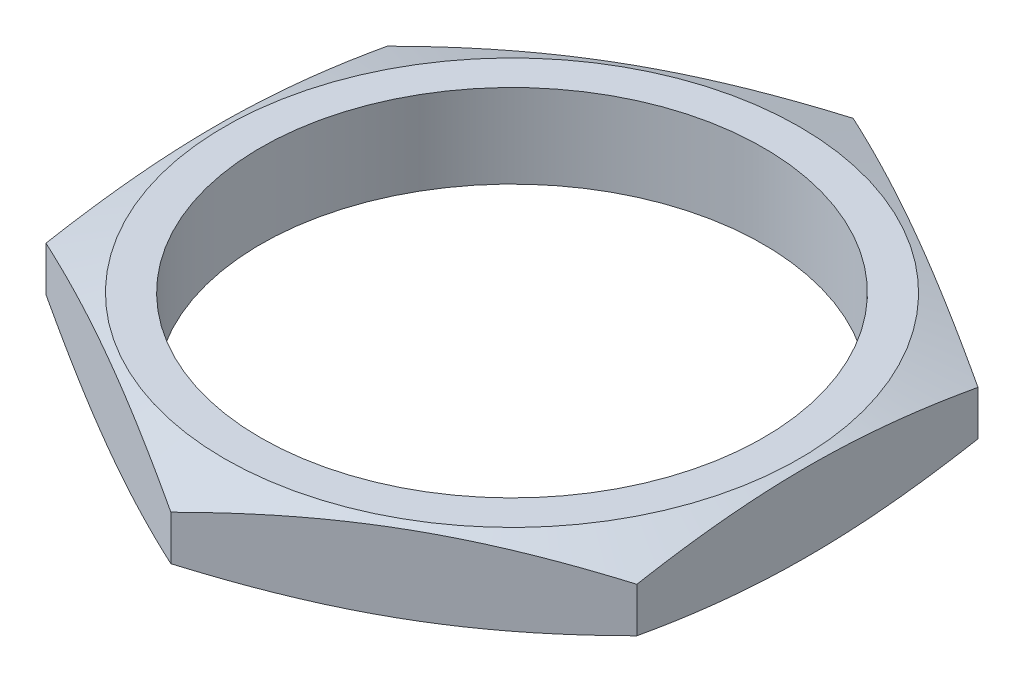
ISO-10303-21;
HEADER;
FILE_DESCRIPTION(('STEP AP214'),'2;1');
FILE_NAME('part.step','',(''),(''),'','','');
FILE_SCHEMA(('AUTOMOTIVE_DESIGN { 1 0 10303 214 1 1 1 1 }'));
ENDSEC;
DATA;
#1=APPLICATION_CONTEXT('core data for automotive mechanical design processes');
#2=APPLICATION_PROTOCOL_DEFINITION('international standard','automotive_design',2000,#1);
#3=PRODUCT_CONTEXT('',#1,'mechanical');
#4=PRODUCT('Part','Part','',(#3));
#5=PRODUCT_RELATED_PRODUCT_CATEGORY('part','',(#4));
#6=PRODUCT_DEFINITION_FORMATION('','',#4);
#7=PRODUCT_DEFINITION_CONTEXT('part definition',#1,'design');
#8=PRODUCT_DEFINITION('design','',#6,#7);
#9=PRODUCT_DEFINITION_SHAPE('','',#8);
#10=(LENGTH_UNIT() NAMED_UNIT(*) SI_UNIT(.MILLI.,.METRE.));
#11=(NAMED_UNIT(*) PLANE_ANGLE_UNIT() SI_UNIT($,.RADIAN.));
#12=(NAMED_UNIT(*) SI_UNIT($,.STERADIAN.) SOLID_ANGLE_UNIT());
#13=UNCERTAINTY_MEASURE_WITH_UNIT(LENGTH_MEASURE(1.E-05),#10,'distance_accuracy_value','');
#14=(GEOMETRIC_REPRESENTATION_CONTEXT(3) GLOBAL_UNCERTAINTY_ASSIGNED_CONTEXT((#13)) GLOBAL_UNIT_ASSIGNED_CONTEXT((#10,
#11,#12)) REPRESENTATION_CONTEXT('',''));
#15=CARTESIAN_POINT('',(0.,0.,0.));
#16=DIRECTION('',(0.,0.,1.));
#17=DIRECTION('',(1.,0.,0.));
#18=AXIS2_PLACEMENT_3D('',#15,#16,#17);
#19=CARTESIAN_POINT('',(-6.9977,1.9812,4.04012397870825));
#20=DIRECTION('',(0.5,0.,-0.866025403784439));
#21=DIRECTION('',(-0.866025403784439,0.,-0.5));
#22=AXIS2_PLACEMENT_3D('',#19,#20,#21);
#23=PLANE('',#22);
#24=CARTESIAN_POINT('',(0.0001999999999964,0.462284226081492,8.08036342747033));
#25=CARTESIAN_POINT('',(-0.289606622206514,0.401362120566391,7.91304349612647));
#26=CARTESIAN_POINT('',(-0.580368898922725,0.345942932358263,7.74517181739417));
#27=CARTESIAN_POINT('',(-1.16378401092152,0.248441457884257,7.40833694543237));
#28=CARTESIAN_POINT('',(-1.45643814390312,0.206369607774267,7.23937300297599));
#29=CARTESIAN_POINT('',(-2.04038919268106,0.138319600140051,6.90222870777048));
#30=CARTESIAN_POINT('',(-2.33167277251057,0.112193015707333,6.7340560545454));
#31=CARTESIAN_POINT('',(-2.91492109926907,0.0771499241840655,6.39731747608698));
#32=CARTESIAN_POINT('',(-3.20688554963454,0.0682269638527959,6.22875172207468));
#33=CARTESIAN_POINT('',(-3.79081445036547,0.0682269638527948,5.89162021405007));
#34=CARTESIAN_POINT('',(-4.08277890073094,0.0771499241840633,5.72305446003776));
#35=CARTESIAN_POINT('',(-4.66602722748944,0.112193015707329,5.38631588157934));
#36=CARTESIAN_POINT('',(-4.95731080731895,0.138319600140046,5.21814322835426));
#37=CARTESIAN_POINT('',(-5.54126185609688,0.20636960777426,4.88099893314875));
#38=CARTESIAN_POINT('',(-5.83391598907849,0.248441457884249,4.71203499069237));
#39=CARTESIAN_POINT('',(-6.41733110107728,0.345942932358253,4.37520011873057));
#40=CARTESIAN_POINT('',(-6.70809337779349,0.401362120566379,4.20732843999828));
#41=CARTESIAN_POINT('',(-6.9979,0.462284226081479,4.04000850865441));
#42=B_SPLINE_CURVE_WITH_KNOTS('',3,(#24,#25,#26,#27,#28,#29,#30,#31,#32,#33,#34,#35,#36,#37,#38,
#39,#40,#41),.UNSPECIFIED.,.F.,.F.,(4,2,2,2,2,2,2,2,4),(0.,1.02052579122587,2.0418475663657,
3.05351126579849,4.06479540680331,5.07607954780812,6.08774324724091,7.10906502238074,
8.12959081360661),.UNSPECIFIED.);
#43=CARTESIAN_POINT('',(0.,0.46224219751807,8.08024795741649));
#44=VERTEX_POINT('',#43);
#45=CARTESIAN_POINT('',(-6.9977,0.462242197518057,4.04012397870825));
#46=VERTEX_POINT('',#45);
#47=EDGE_CURVE('E55',#44,#46,#42,.T.);
#48=ORIENTED_EDGE('',*,*,#47,.F.);
#49=DIRECTION('',(0.,-1.,0.));
#50=VECTOR('',#49,1.);
#51=CARTESIAN_POINT('',(0.,1.9812,8.08024795741649));
#52=LINE('',#51,#50);
#53=CARTESIAN_POINT('',(0.,1.51895780248193,8.0802479574165));
#54=VERTEX_POINT('',#53);
#55=EDGE_CURVE('E48',#54,#44,#52,.T.);
#56=ORIENTED_EDGE('',*,*,#55,.F.);
#57=CARTESIAN_POINT('',(-6.9979,1.5189157739185,4.04000850865441));
#58=CARTESIAN_POINT('',(-6.70809337779349,1.5798378794336,4.20732843999828));
#59=CARTESIAN_POINT('',(-6.41733110107728,1.63525706764173,4.37520011873057));
#60=CARTESIAN_POINT('',(-5.83391598907849,1.73275854211573,4.71203499069237));
#61=CARTESIAN_POINT('',(-5.54126185609688,1.77483039222573,4.88099893314876));
#62=CARTESIAN_POINT('',(-4.95731080731895,1.84288039985994,5.21814322835426));
#63=CARTESIAN_POINT('',(-4.66602722748944,1.86900698429266,5.38631588157934));
#64=CARTESIAN_POINT('',(-4.08277890073094,1.90405007581593,5.72305446003776));
#65=CARTESIAN_POINT('',(-3.79081445036547,1.9129730361472,5.89162021405007));
#66=CARTESIAN_POINT('',(-3.20688554963454,1.9129730361472,6.22875172207468));
#67=CARTESIAN_POINT('',(-2.91492109926907,1.90405007581593,6.39731747608698));
#68=CARTESIAN_POINT('',(-2.33167277251057,1.86900698429266,6.7340560545454));
#69=CARTESIAN_POINT('',(-2.04038919268106,1.84288039985995,6.90222870777048));
#70=CARTESIAN_POINT('',(-1.45643814390312,1.77483039222573,7.23937300297599));
#71=CARTESIAN_POINT('',(-1.16378401092152,1.73275854211574,7.40833694543237));
#72=CARTESIAN_POINT('',(-0.580368898922725,1.63525706764174,7.74517181739417));
#73=CARTESIAN_POINT('',(-0.289606622206514,1.57983787943361,7.91304349612647));
#74=CARTESIAN_POINT('',(0.000199999999995792,1.51891577391851,8.08036342747033));
#75=B_SPLINE_CURVE_WITH_KNOTS('',3,(#57,#58,#59,#60,#61,#62,#63,#64,#65,#66,#67,#68,#69,#70,#71,
#72,#73,#74),.UNSPECIFIED.,.F.,.F.,(4,2,2,2,2,2,2,2,4),(0.,1.02052579122587,2.0418475663657,
3.05351126579849,4.06479540680331,5.07607954780812,6.08774324724091,7.10906502238074,
8.12959081360661),.UNSPECIFIED.);
#76=CARTESIAN_POINT('',(-6.9977,1.51895780248192,4.04012397870825));
#77=VERTEX_POINT('',#76);
#78=EDGE_CURVE('E133',#77,#54,#75,.T.);
#79=ORIENTED_EDGE('',*,*,#78,.F.);
#80=DIRECTION('',(0.,-1.,0.));
#81=VECTOR('',#80,1.);
#82=CARTESIAN_POINT('',(-6.9977,1.9812,4.04012397870825));
#83=LINE('',#82,#81);
#84=EDGE_CURVE('E116',#77,#46,#83,.T.);
#85=ORIENTED_EDGE('',*,*,#84,.T.);
#86=EDGE_LOOP('',(#48,#56,#79,#85));
#87=FACE_BOUND('',#86,.T.);
#88=ADVANCED_FACE('F34',(#87),#23,.F.);
#89=CARTESIAN_POINT('',(0.,1.9812,8.08024795741649));
#90=DIRECTION('',(-0.5,0.,-0.866025403784438));
#91=DIRECTION('',(-0.866025403784438,0.,0.500000000000001));
#92=AXIS2_PLACEMENT_3D('',#89,#90,#91);
#93=PLANE('',#92);
#94=CARTESIAN_POINT('',(6.9979,0.462284226081477,4.04000850865441));
#95=CARTESIAN_POINT('',(6.70809337779349,0.401362120566377,4.20732843999827));
#96=CARTESIAN_POINT('',(6.41733110107728,0.34594293235825,4.37520011873056));
#97=CARTESIAN_POINT('',(5.83391598907848,0.248441457884246,4.71203499069237));
#98=CARTESIAN_POINT('',(5.54126185609688,0.206369607774257,4.88099893314875));
#99=CARTESIAN_POINT('',(4.95731080731894,0.138319600140044,5.21814322835426));
#100=CARTESIAN_POINT('',(4.66602722748943,0.112193015707327,5.38631588157934));
#101=CARTESIAN_POINT('',(4.08277890073093,0.0771499241840611,5.72305446003776));
#102=CARTESIAN_POINT('',(3.79081445036546,0.0682269638527925,5.89162021405007));
#103=CARTESIAN_POINT('',(3.20688554963453,0.0682269638527938,6.22875172207467));
#104=CARTESIAN_POINT('',(2.91492109926906,0.0771499241840637,6.39731747608698));
#105=CARTESIAN_POINT('',(2.33167277251056,0.112193015707332,6.7340560545454));
#106=CARTESIAN_POINT('',(2.04038919268105,0.13831960014005,6.90222870777048));
#107=CARTESIAN_POINT('',(1.45643814390311,0.206369607774266,7.23937300297599));
#108=CARTESIAN_POINT('',(1.16378401092151,0.248441457884256,7.40833694543237));
#109=CARTESIAN_POINT('',(0.580368898922715,0.345942932358263,7.74517181739418));
#110=CARTESIAN_POINT('',(0.289606622206504,0.401362120566392,7.91304349612647));
#111=CARTESIAN_POINT('',(-0.0002000000000056,0.462284226081492,8.08036342747033));
#112=B_SPLINE_CURVE_WITH_KNOTS('',3,(#94,#95,#96,#97,#98,#99,#100,#101,#102,#103,#104,#105,#106,
#107,#108,#109,#110,#111),.UNSPECIFIED.,.F.,.F.,(4,2,2,2,2,2,2,2,4),(0.,1.02052579122587,
2.0418475663657,3.05351126579849,4.06479540680331,5.07607954780813,6.08774324724091,
7.10906502238075,8.12959081360662),.UNSPECIFIED.);
#113=CARTESIAN_POINT('',(6.9977,0.462242197518058,4.04012397870826));
#114=VERTEX_POINT('',#113);
#115=EDGE_CURVE('E128',#114,#44,#112,.T.);
#116=ORIENTED_EDGE('',*,*,#115,.F.);
#117=DIRECTION('',(0.,-1.,0.));
#118=VECTOR('',#117,1.);
#119=CARTESIAN_POINT('',(6.9977,1.9812,4.04012397870824));
#120=LINE('',#119,#118);
#121=CARTESIAN_POINT('',(6.9977,1.51895780248192,4.04012397870826));
#122=VERTEX_POINT('',#121);
#123=EDGE_CURVE('E114',#122,#114,#120,.T.);
#124=ORIENTED_EDGE('',*,*,#123,.F.);
#125=CARTESIAN_POINT('',(-0.000200000000003649,1.51891577391851,8.08036342747033));
#126=CARTESIAN_POINT('',(0.289606622206507,1.57983787943361,7.91304349612647));
#127=CARTESIAN_POINT('',(0.580368898922718,1.63525706764174,7.74517181739417));
#128=CARTESIAN_POINT('',(1.16378401092151,1.73275854211574,7.40833694543237));
#129=CARTESIAN_POINT('',(1.45643814390312,1.77483039222573,7.23937300297599));
#130=CARTESIAN_POINT('',(2.04038919268105,1.84288039985995,6.90222870777048));
#131=CARTESIAN_POINT('',(2.33167277251056,1.86900698429267,6.7340560545454));
#132=CARTESIAN_POINT('',(2.91492109926906,1.90405007581593,6.39731747608698));
#133=CARTESIAN_POINT('',(3.20688554963453,1.9129730361472,6.22875172207467));
#134=CARTESIAN_POINT('',(3.79081445036546,1.9129730361472,5.89162021405007));
#135=CARTESIAN_POINT('',(4.08277890073093,1.90405007581593,5.72305446003776));
#136=CARTESIAN_POINT('',(4.66602722748943,1.86900698429266,5.38631588157934));
#137=CARTESIAN_POINT('',(4.95731080731894,1.84288039985994,5.21814322835426));
#138=CARTESIAN_POINT('',(5.54126185609688,1.77483039222573,4.88099893314875));
#139=CARTESIAN_POINT('',(5.83391598907848,1.73275854211574,4.71203499069237));
#140=CARTESIAN_POINT('',(6.41733110107728,1.63525706764173,4.37520011873056));
#141=CARTESIAN_POINT('',(6.70809337779349,1.5798378794336,4.20732843999827));
#142=CARTESIAN_POINT('',(6.9979,1.5189157739185,4.04000850865441));
#143=B_SPLINE_CURVE_WITH_KNOTS('',3,(#125,#126,#127,#128,#129,#130,#131,#132,#133,#134,#135,
#136,#137,#138,#139,#140,#141,#142),.UNSPECIFIED.,.F.,.F.,(4,2,2,2,2,2,2,2,4),(0.,
1.02052579122587,2.0418475663657,3.05351126579849,4.06479540680331,5.07607954780813,
6.08774324724091,7.10906502238074,8.12959081360662),.UNSPECIFIED.);
#144=EDGE_CURVE('E129',#54,#122,#143,.T.);
#145=ORIENTED_EDGE('',*,*,#144,.F.);
#146=ORIENTED_EDGE('',*,*,#55,.T.);
#147=EDGE_LOOP('',(#116,#124,#145,#146));
#148=FACE_BOUND('',#147,.T.);
#149=ADVANCED_FACE('F126',(#148),#93,.F.);
#150=CARTESIAN_POINT('',(6.9977,1.9812,4.04012397870824));
#151=DIRECTION('',(-1.,0.,0.));
#152=DIRECTION('',(0.,0.,1.));
#153=AXIS2_PLACEMENT_3D('',#150,#151,#152);
#154=PLANE('',#153);
#155=CARTESIAN_POINT('',(6.9977,2.17170909533185,-10.6903296657934));
#156=CARTESIAN_POINT('',(6.9977,2.07534202179328,-10.3737950722668));
#157=CARTESIAN_POINT('',(6.9977,1.98010086786702,-10.0569113181255));
#158=CARTESIAN_POINT('',(6.9977,1.79249327866732,-9.42226774249464));
#159=CARTESIAN_POINT('',(6.9977,1.70012707136944,-9.10450785369376));
#160=CARTESIAN_POINT('',(6.9977,1.51873820336421,-8.46738894368823));
#161=CARTESIAN_POINT('',(6.9977,1.42972212033942,-8.14802804302959));
#162=CARTESIAN_POINT('',(6.9977,1.25607733315345,-7.50811733638434));
#163=CARTESIAN_POINT('',(6.9977,1.17144855004161,-7.18756755190332));
#164=CARTESIAN_POINT('',(6.9977,1.00867754850615,-6.54903846909036));
#165=CARTESIAN_POINT('',(6.9977,0.930468055485341,-6.23107640560138));
#166=CARTESIAN_POINT('',(6.9977,0.780717475875571,-5.5935693275893));
#167=CARTESIAN_POINT('',(6.9977,0.70917650157772,-5.27402428650584));
#168=CARTESIAN_POINT('',(6.9977,0.574432976244225,-4.63328094629298));
#169=CARTESIAN_POINT('',(6.9977,0.511227559313486,-4.31208325504122));
#170=CARTESIAN_POINT('',(6.9977,0.395081519954975,-3.66782344394359));
#171=CARTESIAN_POINT('',(6.9977,0.342140552796491,-3.34476138708767));
#172=CARTESIAN_POINT('',(6.9977,0.253918184454688,-2.73316286312307));
#173=CARTESIAN_POINT('',(6.9977,0.217322117027882,-2.44481781795926));
#174=CARTESIAN_POINT('',(6.9977,0.155395347286137,-1.86691044600163));
#175=CARTESIAN_POINT('',(6.9977,0.130064316437728,-1.57734815495622));
#176=CARTESIAN_POINT('',(6.9977,0.0918876088288441,-0.997593741422638));
#177=CARTESIAN_POINT('',(6.9977,0.0790331258402472,-0.707402208273676));
#178=CARTESIAN_POINT('',(6.9977,0.0664601457747802,-0.126731667816304));
#179=CARTESIAN_POINT('',(6.9977,0.0667415575590627,0.163747337483597));
#180=CARTESIAN_POINT('',(6.9977,0.0804598647845773,0.745868303290137));
#181=CARTESIAN_POINT('',(6.9977,0.0939636946111452,1.0375086601711));
#182=CARTESIAN_POINT('',(6.9977,0.133505604318839,1.6199310347455));
#183=CARTESIAN_POINT('',(6.9977,0.159543985240647,1.91071303165505));
#184=CARTESIAN_POINT('',(6.9977,0.222938300884146,2.49127581057244));
#185=CARTESIAN_POINT('',(6.9977,0.260303946680967,2.7810555168411));
#186=CARTESIAN_POINT('',(6.9977,0.344839045387852,3.35916518193577));
#187=CARTESIAN_POINT('',(6.9977,0.392008549477749,3.64749513318548));
#188=CARTESIAN_POINT('',(6.9977,0.497416320692379,4.23834970256486));
#189=CARTESIAN_POINT('',(6.9977,0.556117933425345,4.54079092658404));
#190=CARTESIAN_POINT('',(6.9977,0.681075232887233,5.14411878404729));
#191=CARTESIAN_POINT('',(6.9977,0.747331490733222,5.44500529815842));
#192=CARTESIAN_POINT('',(6.9977,0.886005182477255,6.04543897481163));
#193=CARTESIAN_POINT('',(6.9977,0.958424410274422,6.34498572048825));
#194=CARTESIAN_POINT('',(6.9977,1.10824546572461,6.94281678447254));
#195=CARTESIAN_POINT('',(6.9977,1.18564717355259,7.24110113295623));
#196=CARTESIAN_POINT('',(6.9977,1.34460116972072,7.83696724155616));
#197=CARTESIAN_POINT('',(6.9977,1.42615864668465,8.13454761265006));
#198=CARTESIAN_POINT('',(6.9977,1.59259319584238,8.72878032522035));
#199=CARTESIAN_POINT('',(6.9977,1.6774703168973,9.0254326529676));
#200=CARTESIAN_POINT('',(6.9977,1.93612809120569,9.91410004197479));
#201=CARTESIAN_POINT('',(6.9977,2.11396454816386,10.5049338252858));
#202=CARTESIAN_POINT('',(6.9977,2.47502941527561,11.6777407761305));
#203=CARTESIAN_POINT('',(6.9977,2.65817583196715,12.2597393940454));
#204=CARTESIAN_POINT('',(6.9977,3.02966337756345,13.422103765092));
#205=CARTESIAN_POINT('',(6.9977,3.21800475630652,14.0024694382071));
#206=CARTESIAN_POINT('',(6.9977,3.59776123862127,15.1597515736897));
#207=CARTESIAN_POINT('',(6.9977,3.78916196103806,15.7366727665487));
#208=CARTESIAN_POINT('',(6.9977,4.0783832409169,16.6013179863972));
#209=CARTESIAN_POINT('',(6.9977,4.17513975794297,16.889398702392));
#210=CARTESIAN_POINT('',(6.9977,4.36927771989661,17.4653487417319));
#211=CARTESIAN_POINT('',(6.9977,4.46665916330518,17.753218065589));
#212=CARTESIAN_POINT('',(6.9977,4.56431116533503,18.040995567708));
#213=B_SPLINE_CURVE_WITH_KNOTS('',3,(#155,#156,#157,#158,#159,#160,#161,#162,#163,#164,#165,
#166,#167,#168,#169,#170,#171,#172,#173,#174,#175,#176,#177,#178,#179,#180,#181,#182,#183,#184,
#185,#186,#187,#188,#189,#190,#191,#192,#193,#194,#195,#196,#197,#198,#199,#200,#201,#202,#203,
#204,#205,#206,#207,#208,#209,#210,#211,#212),.UNSPECIFIED.,.F.,.F.,(4,2,2,2,2,2,2,2,2,2,2,2,2,
2,2,2,2,2,2,2,2,2,2,2,2,2,2,2,4),(0.,0.992643364212821,1.9853652428728,2.97994411827881,
3.97450508975091,4.95676664140526,5.93904473036356,6.92098421136066,7.90289070828535,
8.77467343485566,9.64643073509139,10.5175722809943,11.3887077827847,12.264276057132,
13.1398653609377,14.0162074569226,14.8925541278581,15.8166917498528,16.7408992813049,
17.665376754567,18.5898320031161,19.5154711849025,20.4411239961031,22.2920929770787,
24.1224703355067,25.9529358752252,27.7764532244317,28.6881384144574,29.5998213892971),.UNSPECIFIED.);
#214=CARTESIAN_POINT('',(6.99770000000001,0.462242197518033,-4.04012397870825));
#215=VERTEX_POINT('',#214);
#216=EDGE_CURVE('E109',#215,#114,#213,.T.);
#217=ORIENTED_EDGE('',*,*,#216,.F.);
#218=DIRECTION('',(0.,-1.,0.));
#219=VECTOR('',#218,1.);
#220=CARTESIAN_POINT('',(6.9977,1.9812,-4.04012397870826));
#221=LINE('',#220,#219);
#222=CARTESIAN_POINT('',(6.99770000000001,1.51895780248189,-4.04012397870825));
#223=VERTEX_POINT('',#222);
#224=EDGE_CURVE('E108',#223,#215,#221,.T.);
#225=ORIENTED_EDGE('',*,*,#224,.F.);
#226=CARTESIAN_POINT('',(6.9977,-0.190509095331997,-10.6903296657934));
#227=CARTESIAN_POINT('',(6.9977,-0.0941420217934217,-10.3737950722668));
#228=CARTESIAN_POINT('',(6.9977,0.00109913213284859,-10.0569113181255));
#229=CARTESIAN_POINT('',(6.9977,0.18870672133255,-9.42226774249463));
#230=CARTESIAN_POINT('',(6.9977,0.281072928630435,-9.10450785369376));
#231=CARTESIAN_POINT('',(6.9977,0.462461796635674,-8.46738894368823));
#232=CARTESIAN_POINT('',(6.9977,0.551477879660462,-8.14802804302958));
#233=CARTESIAN_POINT('',(6.9977,0.725122666846442,-7.50811733638433));
#234=CARTESIAN_POINT('',(6.9977,0.809751449958288,-7.18756755190332));
#235=CARTESIAN_POINT('',(6.9977,0.972522451493752,-6.54903846909036));
#236=CARTESIAN_POINT('',(6.9977,1.05073194451457,-6.23107640560138));
#237=CARTESIAN_POINT('',(6.9977,1.20048252412434,-5.5935693275893));
#238=CARTESIAN_POINT('',(6.9977,1.2720234984222,-5.27402428650584));
#239=CARTESIAN_POINT('',(6.9977,1.4067670237557,-4.63328094629298));
#240=CARTESIAN_POINT('',(6.9977,1.46997244068644,-4.31208325504122));
#241=CARTESIAN_POINT('',(6.9977,1.58611848004496,-3.66782344394359));
#242=CARTESIAN_POINT('',(6.9977,1.63905944720344,-3.34476138708766));
#243=CARTESIAN_POINT('',(6.9977,1.72728181554525,-2.73316286312308));
#244=CARTESIAN_POINT('',(6.9977,1.76387788297206,-2.44481781795927));
#245=CARTESIAN_POINT('',(6.9977,1.82580465271381,-1.86691044600165));
#246=CARTESIAN_POINT('',(6.9977,1.85113568356222,-1.57734815495625));
#247=CARTESIAN_POINT('',(6.9977,1.88931239117111,-0.997593741422675));
#248=CARTESIAN_POINT('',(6.9977,1.90216687415971,-0.70740220827372));
#249=CARTESIAN_POINT('',(6.9977,1.91473985422518,-0.12673166781636));
#250=CARTESIAN_POINT('',(6.9977,1.9144584424409,0.163747337483536));
#251=CARTESIAN_POINT('',(6.9977,1.90074013521539,0.745868303290064));
#252=CARTESIAN_POINT('',(6.9977,1.88723630538882,1.03750866017102));
#253=CARTESIAN_POINT('',(6.9977,1.84769439568114,1.61993103474541));
#254=CARTESIAN_POINT('',(6.9977,1.82165601475933,1.91071303165496));
#255=CARTESIAN_POINT('',(6.9977,1.75826169911584,2.49127581057234));
#256=CARTESIAN_POINT('',(6.9977,1.72089605331902,2.78105551684099));
#257=CARTESIAN_POINT('',(6.9977,1.63636095461214,3.35916518193565));
#258=CARTESIAN_POINT('',(6.9977,1.58919145052225,3.64749513318535));
#259=CARTESIAN_POINT('',(6.9977,1.48378367930762,4.23834970256472));
#260=CARTESIAN_POINT('',(6.9977,1.42508206657466,4.54079092658391));
#261=CARTESIAN_POINT('',(6.9977,1.30012476711277,5.14411878404716));
#262=CARTESIAN_POINT('',(6.9977,1.23386850926679,5.44500529815829));
#263=CARTESIAN_POINT('',(6.9977,1.09519481752276,6.04543897481151));
#264=CARTESIAN_POINT('',(6.9977,1.02277558972559,6.34498572048812));
#265=CARTESIAN_POINT('',(6.9977,0.872954534275405,6.94281678447242));
#266=CARTESIAN_POINT('',(6.9977,0.795552826447419,7.24110113295611));
#267=CARTESIAN_POINT('',(6.9977,0.636598830279295,7.83696724155604));
#268=CARTESIAN_POINT('',(6.9977,0.555041353315363,8.13454761264995));
#269=CARTESIAN_POINT('',(6.9977,0.388606804157638,8.72878032522024));
#270=CARTESIAN_POINT('',(6.9977,0.303729683102722,9.02543265296749));
#271=CARTESIAN_POINT('',(6.9977,0.0450719087943303,9.91410004197468));
#272=CARTESIAN_POINT('',(6.9977,-0.132764548163844,10.5049338252857));
#273=CARTESIAN_POINT('',(6.9977,-0.493829415275592,11.6777407761304));
#274=CARTESIAN_POINT('',(6.9977,-0.676975831967125,12.2597393940453));
#275=CARTESIAN_POINT('',(6.9977,-1.04846337756343,13.4221037650919));
#276=CARTESIAN_POINT('',(6.9977,-1.2368047563065,14.002469438207));
#277=CARTESIAN_POINT('',(6.9977,-1.61656123862125,15.1597515736896));
#278=CARTESIAN_POINT('',(6.9977,-1.80796196103804,15.7366727665486));
#279=CARTESIAN_POINT('',(6.9977,-2.09718324091688,16.6013179863971));
#280=CARTESIAN_POINT('',(6.9977,-2.19393975794295,16.8893987023919));
#281=CARTESIAN_POINT('',(6.9977,-2.38807771989659,17.4653487417318));
#282=CARTESIAN_POINT('',(6.9977,-2.48545916330515,17.7532180655889));
#283=CARTESIAN_POINT('',(6.9977,-2.583111165335,18.0409955677079));
#284=B_SPLINE_CURVE_WITH_KNOTS('',3,(#226,#227,#228,#229,#230,#231,#232,#233,#234,#235,#236,
#237,#238,#239,#240,#241,#242,#243,#244,#245,#246,#247,#248,#249,#250,#251,#252,#253,#254,#255,
#256,#257,#258,#259,#260,#261,#262,#263,#264,#265,#266,#267,#268,#269,#270,#271,#272,#273,#274,
#275,#276,#277,#278,#279,#280,#281,#282,#283),.UNSPECIFIED.,.F.,.F.,(4,2,2,2,2,2,2,2,2,2,2,2,2,
2,2,2,2,2,2,2,2,2,2,2,2,2,2,2,4),(0.,0.992643364212823,1.9853652428728,2.97994411827881,
3.97450508975092,4.95676664140526,5.93904473036357,6.92098421136067,7.90289070828536,
8.77467343485565,9.64643073509136,10.5175722809942,11.3887077827847,12.2642760571319,
13.1398653609376,14.0162074569225,14.892554127858,15.8166917498526,16.7408992813047,
17.6653767545669,18.589832003116,19.5154711849024,20.441123996103,22.2920929770786,
24.1224703355066,25.9529358752251,27.7764532244316,28.6881384144573,29.599821389297),.UNSPECIFIED.);
#285=EDGE_CURVE('E191',#122,#223,#284,.F.);
#286=ORIENTED_EDGE('',*,*,#285,.F.);
#287=ORIENTED_EDGE('',*,*,#123,.T.);
#288=EDGE_LOOP('',(#217,#225,#286,#287));
#289=FACE_BOUND('',#288,.T.);
#290=ADVANCED_FACE('F183',(#289),#154,.F.);
#291=CARTESIAN_POINT('',(6.9977,1.9812,-4.04012397870826));
#292=DIRECTION('',(-0.5,0.,0.866025403784439));
#293=DIRECTION('',(0.866025403784439,0.,0.5));
#294=AXIS2_PLACEMENT_3D('',#291,#292,#293);
#295=PLANE('',#294);
#296=CARTESIAN_POINT('',(-0.000199999999998126,0.462284226081442,-8.08036342747033));
#297=CARTESIAN_POINT('',(0.289606622206512,0.401362120566343,-7.91304349612647));
#298=CARTESIAN_POINT('',(0.580368898922723,0.345942932358216,-7.74517181739418));
#299=CARTESIAN_POINT('',(1.16378401092152,0.248441457884212,-7.40833694543238));
#300=CARTESIAN_POINT('',(1.45643814390312,0.206369607774223,-7.23937300297599));
#301=CARTESIAN_POINT('',(2.04038919268106,0.13831960014001,-6.90222870777049));
#302=CARTESIAN_POINT('',(2.33167277251056,0.112193015707293,-6.7340560545454));
#303=CARTESIAN_POINT('',(2.91492109926907,0.0771499241840268,-6.39731747608698));
#304=CARTESIAN_POINT('',(3.20688554963453,0.0682269638527579,-6.22875172207468));
#305=CARTESIAN_POINT('',(3.79081445036547,0.0682269638527589,-5.89162021405007));
#306=CARTESIAN_POINT('',(4.08277890073094,0.0771499241840288,-5.72305446003777));
#307=CARTESIAN_POINT('',(4.66602722748944,0.112193015707296,-5.38631588157935));
#308=CARTESIAN_POINT('',(4.95731080731895,0.138319600140014,-5.21814322835426));
#309=CARTESIAN_POINT('',(5.54126185609688,0.20636960777423,-4.88099893314876));
#310=CARTESIAN_POINT('',(5.83391598907848,0.248441457884219,-4.71203499069237));
#311=CARTESIAN_POINT('',(6.41733110107728,0.345942932358225,-4.37520011873057));
#312=CARTESIAN_POINT('',(6.70809337779349,0.401362120566353,-4.20732843999828));
#313=CARTESIAN_POINT('',(6.9979,0.462284226081453,-4.04000850865442));
#314=B_SPLINE_CURVE_WITH_KNOTS('',3,(#296,#297,#298,#299,#300,#301,#302,#303,#304,#305,#306,
#307,#308,#309,#310,#311,#312,#313),.UNSPECIFIED.,.F.,.F.,(4,2,2,2,2,2,2,2,4),(0.,
1.02052579122587,2.0418475663657,3.05351126579849,4.0647954068033,5.07607954780812,
6.08774324724091,7.10906502238073,8.12959081360661),.UNSPECIFIED.);
#315=CARTESIAN_POINT('',(0.,0.46224219751802,-8.0802479574165));
#316=VERTEX_POINT('',#315);
#317=EDGE_CURVE('E93',#316,#215,#314,.T.);
#318=ORIENTED_EDGE('',*,*,#317,.F.);
#319=DIRECTION('',(0.,-1.,0.));
#320=VECTOR('',#319,1.);
#321=CARTESIAN_POINT('',(0.,1.9812,-8.0802479574165));
#322=LINE('',#321,#320);
#323=CARTESIAN_POINT('',(0.,1.51895780248188,-8.0802479574165));
#324=VERTEX_POINT('',#323);
#325=EDGE_CURVE('E106',#324,#316,#322,.T.);
#326=ORIENTED_EDGE('',*,*,#325,.F.);
#327=CARTESIAN_POINT('',(6.9979,1.51891577391847,-4.04000850865442));
#328=CARTESIAN_POINT('',(6.70809337779349,1.57983787943358,-4.20732843999828));
#329=CARTESIAN_POINT('',(6.41733110107728,1.6352570676417,-4.37520011873058));
#330=CARTESIAN_POINT('',(5.83391598907848,1.73275854211571,-4.71203499069238));
#331=CARTESIAN_POINT('',(5.54126185609688,1.7748303922257,-4.88099893314876));
#332=CARTESIAN_POINT('',(4.95731080731894,1.84288039985991,-5.21814322835427));
#333=CARTESIAN_POINT('',(4.66602722748944,1.86900698429263,-5.38631588157935));
#334=CARTESIAN_POINT('',(4.08277890073093,1.9040500758159,-5.72305446003777));
#335=CARTESIAN_POINT('',(3.79081445036547,1.91297303614717,-5.89162021405007));
#336=CARTESIAN_POINT('',(3.20688554963453,1.91297303614716,-6.22875172207468));
#337=CARTESIAN_POINT('',(2.91492109926907,1.90405007581589,-6.39731747608698));
#338=CARTESIAN_POINT('',(2.33167277251056,1.86900698429263,-6.7340560545454));
#339=CARTESIAN_POINT('',(2.04038919268106,1.84288039985991,-6.90222870777049));
#340=CARTESIAN_POINT('',(1.45643814390312,1.77483039222569,-7.23937300297599));
#341=CARTESIAN_POINT('',(1.16378401092152,1.7327585421157,-7.40833694543238));
#342=CARTESIAN_POINT('',(0.580368898922722,1.63525706764169,-7.74517181739418));
#343=CARTESIAN_POINT('',(0.289606622206511,1.57983787943356,-7.91304349612647));
#344=CARTESIAN_POINT('',(-0.000199999999999107,1.51891577391846,-8.08036342747033));
#345=B_SPLINE_CURVE_WITH_KNOTS('',3,(#327,#328,#329,#330,#331,#332,#333,#334,#335,#336,#337,
#338,#339,#340,#341,#342,#343,#344),.UNSPECIFIED.,.F.,.F.,(4,2,2,2,2,2,2,2,4),(0.,
1.02052579122587,2.0418475663657,3.05351126579849,4.0647954068033,5.07607954780812,
6.08774324724091,7.10906502238074,8.12959081360661),.UNSPECIFIED.);
#346=EDGE_CURVE('E198',#223,#324,#345,.T.);
#347=ORIENTED_EDGE('',*,*,#346,.F.);
#348=ORIENTED_EDGE('',*,*,#224,.T.);
#349=EDGE_LOOP('',(#318,#326,#347,#348));
#350=FACE_BOUND('',#349,.T.);
#351=ADVANCED_FACE('F104',(#350),#295,.F.);
#352=CARTESIAN_POINT('',(0.,1.9812,-8.0802479574165));
#353=DIRECTION('',(0.5,0.,0.866025403784438));
#354=DIRECTION('',(0.866025403784439,0.,-0.5));
#355=AXIS2_PLACEMENT_3D('',#352,#353,#354);
#356=PLANE('',#355);
#357=CARTESIAN_POINT('',(-6.9979,0.462284226081454,-4.04000850865441));
#358=CARTESIAN_POINT('',(-6.70809337779349,0.401362120566353,-4.20732843999827));
#359=CARTESIAN_POINT('',(-6.41733110107728,0.345942932358225,-4.37520011873057));
#360=CARTESIAN_POINT('',(-5.83391598907849,0.248441457884219,-4.71203499069237));
#361=CARTESIAN_POINT('',(-5.54126185609688,0.206369607774229,-4.88099893314875));
#362=CARTESIAN_POINT('',(-4.95731080731895,0.138319600140013,-5.21814322835426));
#363=CARTESIAN_POINT('',(-4.66602722748944,0.112193015707295,-5.38631588157934));
#364=CARTESIAN_POINT('',(-4.08277890073094,0.0771499241840275,-5.72305446003776));
#365=CARTESIAN_POINT('',(-3.79081445036547,0.0682269638527577,-5.89162021405007));
#366=CARTESIAN_POINT('',(-3.20688554963453,0.0682269638527569,-6.22875172207467));
#367=CARTESIAN_POINT('',(-2.91492109926907,0.0771499241840258,-6.39731747608698));
#368=CARTESIAN_POINT('',(-2.33167277251056,0.112193015707291,-6.7340560545454));
#369=CARTESIAN_POINT('',(-2.04038919268106,0.138319600140008,-6.90222870777048));
#370=CARTESIAN_POINT('',(-1.45643814390312,0.206369607774222,-7.23937300297599));
#371=CARTESIAN_POINT('',(-1.16378401092152,0.248441457884211,-7.40833694543237));
#372=CARTESIAN_POINT('',(-0.580368898922721,0.345942932358215,-7.74517181739418));
#373=CARTESIAN_POINT('',(-0.28960662220651,0.401362120566342,-7.91304349612647));
#374=CARTESIAN_POINT('',(0.000200000000000757,0.462284226081442,-8.08036342747033));
#375=B_SPLINE_CURVE_WITH_KNOTS('',3,(#357,#358,#359,#360,#361,#362,#363,#364,#365,#366,#367,
#368,#369,#370,#371,#372,#373,#374),.UNSPECIFIED.,.F.,.F.,(4,2,2,2,2,2,2,2,4),(0.,
1.02052579122587,2.0418475663657,3.05351126579849,4.06479540680331,5.07607954780813,
6.08774324724091,7.10906502238074,8.12959081360662),.UNSPECIFIED.);
#376=CARTESIAN_POINT('',(-6.99770000000001,0.462242197518033,-4.04012397870825));
#377=VERTEX_POINT('',#376);
#378=EDGE_CURVE('E90',#377,#316,#375,.T.);
#379=ORIENTED_EDGE('',*,*,#378,.F.);
#380=DIRECTION('',(0.,-1.,0.));
#381=VECTOR('',#380,1.);
#382=CARTESIAN_POINT('',(-6.9977,1.9812,-4.04012397870825));
#383=LINE('',#382,#381);
#384=CARTESIAN_POINT('',(-6.9977,1.5189578024819,-4.04012397870825));
#385=VERTEX_POINT('',#384);
#386=EDGE_CURVE('E112',#385,#377,#383,.T.);
#387=ORIENTED_EDGE('',*,*,#386,.F.);
#388=CARTESIAN_POINT('',(0.00020000000000192,1.51891577391846,-8.08036342747033));
#389=CARTESIAN_POINT('',(-0.289606622206509,1.57983787943356,-7.91304349612647));
#390=CARTESIAN_POINT('',(-0.58036889892272,1.63525706764169,-7.74517181739418));
#391=CARTESIAN_POINT('',(-1.16378401092152,1.7327585421157,-7.40833694543237));
#392=CARTESIAN_POINT('',(-1.45643814390312,1.77483039222569,-7.23937300297599));
#393=CARTESIAN_POINT('',(-2.04038919268106,1.84288039985991,-6.90222870777048));
#394=CARTESIAN_POINT('',(-2.33167277251056,1.86900698429263,-6.7340560545454));
#395=CARTESIAN_POINT('',(-2.91492109926907,1.9040500758159,-6.39731747608698));
#396=CARTESIAN_POINT('',(-3.20688554963453,1.91297303614717,-6.22875172207467));
#397=CARTESIAN_POINT('',(-3.79081445036547,1.91297303614717,-5.89162021405007));
#398=CARTESIAN_POINT('',(-4.08277890073094,1.9040500758159,-5.72305446003776));
#399=CARTESIAN_POINT('',(-4.66602722748944,1.86900698429263,-5.38631588157934));
#400=CARTESIAN_POINT('',(-4.95731080731895,1.84288039985991,-5.21814322835426));
#401=CARTESIAN_POINT('',(-5.54126185609688,1.7748303922257,-4.88099893314875));
#402=CARTESIAN_POINT('',(-5.83391598907849,1.73275854211571,-4.71203499069237));
#403=CARTESIAN_POINT('',(-6.41733110107728,1.6352570676417,-4.37520011873057));
#404=CARTESIAN_POINT('',(-6.70809337779349,1.57983787943358,-4.20732843999827));
#405=CARTESIAN_POINT('',(-6.9979,1.51891577391847,-4.04000850865441));
#406=B_SPLINE_CURVE_WITH_KNOTS('',3,(#388,#389,#390,#391,#392,#393,#394,#395,#396,#397,#398,
#399,#400,#401,#402,#403,#404,#405),.UNSPECIFIED.,.F.,.F.,(4,2,2,2,2,2,2,2,4),(0.,
1.02052579122587,2.0418475663657,3.05351126579849,4.06479540680331,5.07607954780813,
6.08774324724092,7.10906502238075,8.12959081360662),.UNSPECIFIED.);
#407=EDGE_CURVE('E62',#324,#385,#406,.T.);
#408=ORIENTED_EDGE('',*,*,#407,.F.);
#409=ORIENTED_EDGE('',*,*,#325,.T.);
#410=EDGE_LOOP('',(#379,#387,#408,#409));
#411=FACE_BOUND('',#410,.T.);
#412=ADVANCED_FACE('F111',(#411),#356,.F.);
#413=CARTESIAN_POINT('',(-6.9977,1.9812,-4.04012397870825));
#414=DIRECTION('',(1.,0.,0.));
#415=DIRECTION('',(0.,0.,-1.));
#416=AXIS2_PLACEMENT_3D('',#413,#414,#415);
#417=PLANE('',#416);
#418=CARTESIAN_POINT('',(-6.99770000000001,2.17171073524919,-10.6903350508816));
#419=CARTESIAN_POINT('',(-6.99770000000001,2.07534358367273,-10.3738002487994));
#420=CARTESIAN_POINT('',(-6.99770000000001,1.98010235191724,-10.0569162859841));
#421=CARTESIAN_POINT('',(-6.99770000000001,1.79249460799388,-9.42227229255872));
#422=CARTESIAN_POINT('',(-6.99770000000001,1.70012832380172,-9.10451219463741));
#423=CARTESIAN_POINT('',(-6.99770000000001,1.51873930306606,-8.46739286444726));
#424=CARTESIAN_POINT('',(-6.9977,1.42972314421837,-8.14803175272031));
#425=CARTESIAN_POINT('',(-6.9977,1.25607820777547,-7.50812062305961));
#426=CARTESIAN_POINT('',(-6.9977,1.17144935122948,-7.18757062663149));
#427=CARTESIAN_POINT('',(-6.9977,1.00867820742694,-6.54904112133382));
#428=CARTESIAN_POINT('',(-6.9977,0.930468645527089,-6.23107884732274));
#429=CARTESIAN_POINT('',(-6.9977,0.780717933653702,-5.59357134657829));
#430=CARTESIAN_POINT('',(-6.9977,0.70917689597194,-5.27402609328441));
#431=CARTESIAN_POINT('',(-6.9977,0.574433252167109,-4.63328232702509));
#432=CARTESIAN_POINT('',(-6.9977,0.511227780135137,-4.31208442194035));
#433=CARTESIAN_POINT('',(-6.9977,0.395081642335376,-3.66782418073687));
#434=CARTESIAN_POINT('',(-6.9977,0.342140631833876,-3.34476190760864));
#435=CARTESIAN_POINT('',(-6.9977,0.253918232073747,-2.73316321755309));
#436=CARTESIAN_POINT('',(-6.9977,0.217322166552585,-2.44481822404112));
#437=CARTESIAN_POINT('',(-6.9977,0.155395395894617,-1.86691095566354));
#438=CARTESIAN_POINT('',(-6.9977,0.130064362224465,-1.57734871654633));
#439=CARTESIAN_POINT('',(-6.9977,0.0918876438469458,-0.997594406757768));
#440=CARTESIAN_POINT('',(-6.9977,0.0790331529168269,-0.707402925425548));
#441=CARTESIAN_POINT('',(-6.9977,0.0664601519922487,-0.126732488181082));
#442=CARTESIAN_POINT('',(-6.9977,0.0667415508589539,0.163746465722651));
#443=CARTESIAN_POINT('',(-6.9977,0.0804598278678542,0.745867327347163));
#444=CARTESIAN_POINT('',(-6.9977,0.0939636402886977,1.03750763144808));
#445=CARTESIAN_POINT('',(-6.9977,0.133505511840329,1.6199299013657));
#446=CARTESIAN_POINT('',(-6.9977,0.15954387201132,1.91071184639856));
#447=CARTESIAN_POINT('',(-6.9977,0.222938143983369,2.49127452223393));
#448=CARTESIAN_POINT('',(-6.9977,0.260303766851372,2.78105417729871));
#449=CARTESIAN_POINT('',(-6.9977,0.344838818582908,3.35916374070019));
#450=CARTESIAN_POINT('',(-6.9977,0.392008298626227,3.6474936414606));
#451=CARTESIAN_POINT('',(-6.9977,0.497416029429991,4.23834816023383));
#452=CARTESIAN_POINT('',(-6.9977,0.556117627372581,4.54078938387793));
#453=CARTESIAN_POINT('',(-6.9977,0.681074899716228,5.14411724042381));
#454=CARTESIAN_POINT('',(-6.9977,0.74733114523493,5.44500375399256));
#455=CARTESIAN_POINT('',(-6.9977,0.886004814410144,6.04543742937323));
#456=CARTESIAN_POINT('',(-6.9977,0.958424031967783,6.34498417431928));
#457=CARTESIAN_POINT('',(-6.9977,1.10824506863425,6.942815236562));
#458=CARTESIAN_POINT('',(-6.9977,1.18564676791794,7.2410995840347));
#459=CARTESIAN_POINT('',(-6.9977,1.34460074849146,7.83696569088055));
#460=CARTESIAN_POINT('',(-6.9977,1.42615821841408,8.13454606122908));
#461=CARTESIAN_POINT('',(-6.9977,1.59259275459185,8.72877877207078));
#462=CARTESIAN_POINT('',(-6.9977,1.67746986970817,9.0254310988348));
#463=CARTESIAN_POINT('',(-6.9977,1.93612762748657,9.91409848451124));
#464=CARTESIAN_POINT('',(-6.9977,2.11396407515611,10.5049322651658));
#465=CARTESIAN_POINT('',(-6.9977,2.47502893110363,11.6777392267547));
#466=CARTESIAN_POINT('',(-6.9977,2.6581753461018,12.2597378580128));
#467=CARTESIAN_POINT('',(-6.9977,3.02966288998916,13.4221022552727));
#468=CARTESIAN_POINT('',(-6.9977,3.21800426871691,14.0024679412578));
#469=CARTESIAN_POINT('',(-6.9977,3.59776075144475,15.1597501000443));
#470=CARTESIAN_POINT('',(-6.9977,3.78916147427241,15.736671303343));
#471=CARTESIAN_POINT('',(-6.9977,4.07838275532236,16.6013165386572));
#472=CARTESIAN_POINT('',(-6.9977,4.17513927282868,16.8893972597671));
#473=CARTESIAN_POINT('',(-6.9977,4.3692772359011,17.4653473092862));
#474=CARTESIAN_POINT('',(-6.9977,4.46665867994819,17.7532166382073));
#475=CARTESIAN_POINT('',(-6.9977,4.56431068268172,18.0409941453689));
#476=B_SPLINE_CURVE_WITH_KNOTS('',3,(#418,#419,#420,#421,#422,#423,#424,#425,#426,#427,#428,
#429,#430,#431,#432,#433,#434,#435,#436,#437,#438,#439,#440,#441,#442,#443,#444,#445,#446,#447,
#448,#449,#450,#451,#452,#453,#454,#455,#456,#457,#458,#459,#460,#461,#462,#463,#464,#465,#466,
#467,#468,#469,#470,#471,#472,#473,#474,#475),.UNSPECIFIED.,.F.,.F.,(4,2,2,2,2,2,2,2,2,2,2,2,2,
2,2,2,2,2,2,2,2,2,2,2,2,2,2,2,4),(0.,0.992644030945643,1.98536657642117,2.9799461228482,
3.97450776531082,4.95676997956081,5.9390487312101,6.92098887337161,7.90289603118929,
8.77467860345971,9.64643574939896,10.5175771412367,11.3887124889615,12.2642806028476,
13.1398697461604,14.0162116810224,14.8925581908306,15.8166958031862,16.7409033250464,
17.6653807889238,18.5898360280758,19.5154752021064,20.4411280055606,22.2920969708216,
24.1224743658901,25.9529399423081,27.7764573216235,28.6881425266547,29.5998255164985),.UNSPECIFIED.);
#477=EDGE_CURVE('E95',#46,#377,#476,.F.);
#478=ORIENTED_EDGE('',*,*,#477,.F.);
#479=ORIENTED_EDGE('',*,*,#84,.F.);
#480=CARTESIAN_POINT('',(-6.99770000000001,-0.190510735249337,-10.6903350508816));
#481=CARTESIAN_POINT('',(-6.99770000000001,-0.0941435836728654,-10.3738002487994));
#482=CARTESIAN_POINT('',(-6.99770000000001,0.0010976480826244,-10.0569162859841));
#483=CARTESIAN_POINT('',(-6.99770000000001,0.188705392005991,-9.42227229255871));
#484=CARTESIAN_POINT('',(-6.99770000000001,0.28107167619816,-9.1045121946374));
#485=CARTESIAN_POINT('',(-6.99770000000001,0.462460696933825,-8.46739286444725));
#486=CARTESIAN_POINT('',(-6.9977,0.551476855781515,-8.14803175272031));
#487=CARTESIAN_POINT('',(-6.9977,0.725121792224419,-7.50812062305961));
#488=CARTESIAN_POINT('',(-6.9977,0.809750648770411,-7.18757062663149));
#489=CARTESIAN_POINT('',(-6.9977,0.972521792572963,-6.54904112133381));
#490=CARTESIAN_POINT('',(-6.9977,1.05073135447282,-6.23107884732273));
#491=CARTESIAN_POINT('',(-6.9977,1.20048206634621,-5.59357134657829));
#492=CARTESIAN_POINT('',(-6.9977,1.27202310402797,-5.27402609328441));
#493=CARTESIAN_POINT('',(-6.9977,1.40676674783281,-4.63328232702509));
#494=CARTESIAN_POINT('',(-6.9977,1.46997221986479,-4.31208442194035));
#495=CARTESIAN_POINT('',(-6.9977,1.58611835766456,-3.66782418073687));
#496=CARTESIAN_POINT('',(-6.9977,1.63905936816606,-3.34476190760864));
#497=CARTESIAN_POINT('',(-6.9977,1.72728176792619,-2.7331632175531));
#498=CARTESIAN_POINT('',(-6.9977,1.76387783344735,-2.44481822404113));
#499=CARTESIAN_POINT('',(-6.9977,1.82580460410533,-1.86691095566357));
#500=CARTESIAN_POINT('',(-6.9977,1.85113563777548,-1.57734871654636));
#501=CARTESIAN_POINT('',(-6.9977,1.889312356153,-0.997594406757809));
#502=CARTESIAN_POINT('',(-6.9977,1.90216684708313,-0.707402925425594));
#503=CARTESIAN_POINT('',(-6.9977,1.91473984800771,-0.12673248818114));
#504=CARTESIAN_POINT('',(-6.9977,1.91445844914101,0.163746465722588));
#505=CARTESIAN_POINT('',(-6.9977,1.90074017213211,0.745867327347087));
#506=CARTESIAN_POINT('',(-6.9977,1.88723635971127,1.037507631448));
#507=CARTESIAN_POINT('',(-6.9977,1.84769448815965,1.6199299013656));
#508=CARTESIAN_POINT('',(-6.9977,1.82165612798866,1.91071184639846));
#509=CARTESIAN_POINT('',(-6.9977,1.75826185601661,2.49127452223382));
#510=CARTESIAN_POINT('',(-6.9977,1.72089623314861,2.7810541772986));
#511=CARTESIAN_POINT('',(-6.9977,1.63636118141709,3.35916374070007));
#512=CARTESIAN_POINT('',(-6.9977,1.58919170137377,3.64749364146047));
#513=CARTESIAN_POINT('',(-6.9977,1.48378397057001,4.2383481602337));
#514=CARTESIAN_POINT('',(-6.9977,1.42508237262742,4.5407893838778));
#515=CARTESIAN_POINT('',(-6.9977,1.30012510028378,5.14411724042368));
#516=CARTESIAN_POINT('',(-6.9977,1.23386885476508,5.44500375399244));
#517=CARTESIAN_POINT('',(-6.9977,1.09519518558987,6.0454374293731));
#518=CARTESIAN_POINT('',(-6.9977,1.02277596803223,6.34498417431915));
#519=CARTESIAN_POINT('',(-6.9977,0.872954931365763,6.94281523656187));
#520=CARTESIAN_POINT('',(-6.9977,0.795553232082078,7.24109958403457));
#521=CARTESIAN_POINT('',(-6.9977,0.63659925150856,7.83696569088042));
#522=CARTESIAN_POINT('',(-6.9977,0.555041781585939,8.13454606122896));
#523=CARTESIAN_POINT('',(-6.9977,0.388607245408172,8.72877877207065));
#524=CARTESIAN_POINT('',(-6.9977,0.303730130291851,9.02543109883468));
#525=CARTESIAN_POINT('',(-6.9977,0.0450723725134557,9.91409848451112));
#526=CARTESIAN_POINT('',(-6.9977,-0.132764075156089,10.5049322651656));
#527=CARTESIAN_POINT('',(-6.9977,-0.493828931103609,11.6777392267546));
#528=CARTESIAN_POINT('',(-6.9977,-0.676975346101773,12.2597378580127));
#529=CARTESIAN_POINT('',(-6.9977,-1.04846288998914,13.4221022552726));
#530=CARTESIAN_POINT('',(-6.9977,-1.23680426871688,14.0024679412577));
#531=CARTESIAN_POINT('',(-6.9977,-1.61656075144472,15.1597501000442));
#532=CARTESIAN_POINT('',(-6.9977,-1.80796147427238,15.7366713033429));
#533=CARTESIAN_POINT('',(-6.9977,-2.09718275532233,16.6013165386571));
#534=CARTESIAN_POINT('',(-6.9977,-2.19393927282865,16.889397259767));
#535=CARTESIAN_POINT('',(-6.9977,-2.38807723590107,17.4653473092861));
#536=CARTESIAN_POINT('',(-6.9977,-2.48545867994817,17.7532166382072));
#537=CARTESIAN_POINT('',(-6.9977,-2.58311068268169,18.0409941453688));
#538=B_SPLINE_CURVE_WITH_KNOTS('',3,(#480,#481,#482,#483,#484,#485,#486,#487,#488,#489,#490,
#491,#492,#493,#494,#495,#496,#497,#498,#499,#500,#501,#502,#503,#504,#505,#506,#507,#508,#509,
#510,#511,#512,#513,#514,#515,#516,#517,#518,#519,#520,#521,#522,#523,#524,#525,#526,#527,#528,
#529,#530,#531,#532,#533,#534,#535,#536,#537),.UNSPECIFIED.,.F.,.F.,(4,2,2,2,2,2,2,2,2,2,2,2,2,
2,2,2,2,2,2,2,2,2,2,2,2,2,2,2,4),(0.,0.992644030945647,1.98536657642117,2.9799461228482,
3.97450776531082,4.95676997956081,5.9390487312101,6.92098887337161,7.90289603118929,
8.77467860345969,9.64643574939894,10.5175771412366,11.3887124889615,12.2642806028475,
13.1398697461603,14.0162116810223,14.8925581908305,15.8166958031861,16.7409033250462,
17.6653807889237,18.5898360280757,19.5154752021063,20.4411280055605,22.2920969708215,
24.12247436589,25.952939942308,27.7764573216234,28.6881425266546,29.5998255164984),.UNSPECIFIED.);
#539=EDGE_CURVE('E11',#385,#77,#538,.T.);
#540=ORIENTED_EDGE('',*,*,#539,.F.);
#541=ORIENTED_EDGE('',*,*,#386,.T.);
#542=EDGE_LOOP('',(#478,#479,#540,#541));
#543=FACE_BOUND('',#542,.T.);
#544=ADVANCED_FACE('F255',(#543),#417,.F.);
#545=CARTESIAN_POINT('',(0.,0.,0.));
#546=DIRECTION('',(0.,1.,0.));
#547=DIRECTION('',(0.,0.,1.));
#548=AXIS2_PLACEMENT_3D('',#545,#546,#547);
#549=PLANE('',#548);
#550=CARTESIAN_POINT('',(0.,0.,0.));
#551=DIRECTION('',(0.,1.,0.));
#552=DIRECTION('',(0.,0.,1.));
#553=AXIS2_PLACEMENT_3D('',#550,#551,#552);
#554=CIRCLE('',#553,5.953125);
#555=CARTESIAN_POINT('',(0.,0.,5.953125));
#556=VERTEX_POINT('',#555);
#557=EDGE_CURVE('E213',#556,#556,#554,.T.);
#558=ORIENTED_EDGE('',*,*,#557,.T.);
#559=EDGE_LOOP('',(#558));
#560=FACE_BOUND('',#559,.T.);
#561=CARTESIAN_POINT('',(0.,0.,0.));
#562=DIRECTION('',(0.,-1.,0.));
#563=DIRECTION('',(0.,0.,-1.));
#564=AXIS2_PLACEMENT_3D('',#561,#562,#563);
#565=CIRCLE('',#564,6.81024795741649);
#566=CARTESIAN_POINT('',(0.,0.,-6.81024795741649));
#567=VERTEX_POINT('',#566);
#568=EDGE_CURVE('E316',#567,#567,#565,.T.);
#569=ORIENTED_EDGE('',*,*,#568,.T.);
#570=EDGE_LOOP('',(#569));
#571=FACE_BOUND('',#570,.T.);
#572=ADVANCED_FACE('F220',(#560,#571),#549,.F.);
#573=CARTESIAN_POINT('',(0.,1.9812,0.));
#574=DIRECTION('',(0.,1.,0.));
#575=DIRECTION('',(0.,0.,1.));
#576=AXIS2_PLACEMENT_3D('',#573,#574,#575);
#577=PLANE('',#576);
#578=CARTESIAN_POINT('',(0.,1.9812,0.));
#579=DIRECTION('',(0.,1.,0.));
#580=DIRECTION('',(0.,0.,1.));
#581=AXIS2_PLACEMENT_3D('',#578,#579,#580);
#582=CIRCLE('',#581,5.953125);
#583=CARTESIAN_POINT('',(0.,1.9812,5.953125));
#584=VERTEX_POINT('',#583);
#585=EDGE_CURVE('E214',#584,#584,#582,.T.);
#586=ORIENTED_EDGE('',*,*,#585,.F.);
#587=EDGE_LOOP('',(#586));
#588=FACE_BOUND('',#587,.T.);
#589=CARTESIAN_POINT('',(0.,1.98119999999998,0.));
#590=DIRECTION('',(0.,-1.,0.));
#591=DIRECTION('',(0.,0.,-1.));
#592=AXIS2_PLACEMENT_3D('',#589,#590,#591);
#593=CIRCLE('',#592,6.8102479574165);
#594=CARTESIAN_POINT('',(0.,1.98119999999996,-6.81024795741651));
#595=VERTEX_POINT('',#594);
#596=EDGE_CURVE('E135',#595,#595,#593,.T.);
#597=ORIENTED_EDGE('',*,*,#596,.F.);
#598=EDGE_LOOP('',(#597));
#599=FACE_BOUND('',#598,.T.);
#600=ADVANCED_FACE('F225',(#588,#599),#577,.T.);
#601=CARTESIAN_POINT('',(0.,1.9812,0.));
#602=DIRECTION('',(0.,-1.,0.));
#603=DIRECTION('',(0.,0.,-1.));
#604=AXIS2_PLACEMENT_3D('',#601,#602,#603);
#605=CYLINDRICAL_SURFACE('',#604,5.953125);
#606=ORIENTED_EDGE('',*,*,#585,.T.);
#607=EDGE_LOOP('',(#606));
#608=FACE_BOUND('',#607,.T.);
#609=ORIENTED_EDGE('',*,*,#557,.F.);
#610=EDGE_LOOP('',(#609));
#611=FACE_BOUND('',#610,.T.);
#612=ADVANCED_FACE('F223',(#608,#611),#605,.F.);
#613=CARTESIAN_POINT('',(0.,1.51895780248191,0.));
#614=DIRECTION('',(0.,-1.,0.));
#615=DIRECTION('',(0.,0.,-1.));
#616=AXIS2_PLACEMENT_3D('',#613,#614,#615);
#617=CONICAL_SURFACE('',#616,8.0802479574165,1.22173047639603);
#618=ORIENTED_EDGE('',*,*,#596,.T.);
#619=EDGE_LOOP('',(#618));
#620=FACE_BOUND('',#619,.T.);
#621=ORIENTED_EDGE('',*,*,#78,.T.);
#622=ORIENTED_EDGE('',*,*,#144,.T.);
#623=ORIENTED_EDGE('',*,*,#285,.T.);
#624=ORIENTED_EDGE('',*,*,#346,.T.);
#625=ORIENTED_EDGE('',*,*,#407,.T.);
#626=ORIENTED_EDGE('',*,*,#539,.T.);
#627=EDGE_LOOP('',(#621,#622,#623,#624,#625,#626));
#628=FACE_BOUND('',#627,.T.);
#629=ADVANCED_FACE('F153',(#620,#628),#617,.T.);
#630=CARTESIAN_POINT('',(0.,0.,0.));
#631=DIRECTION('',(0.,1.,0.));
#632=DIRECTION('',(0.,0.,1.));
#633=AXIS2_PLACEMENT_3D('',#630,#631,#632);
#634=CONICAL_SURFACE('',#633,6.81024795741649,1.22173047639604);
#635=ORIENTED_EDGE('',*,*,#568,.F.);
#636=EDGE_LOOP('',(#635));
#637=FACE_BOUND('',#636,.T.);
#638=ORIENTED_EDGE('',*,*,#47,.T.);
#639=ORIENTED_EDGE('',*,*,#477,.T.);
#640=ORIENTED_EDGE('',*,*,#378,.T.);
#641=ORIENTED_EDGE('',*,*,#317,.T.);
#642=ORIENTED_EDGE('',*,*,#216,.T.);
#643=ORIENTED_EDGE('',*,*,#115,.T.);
#644=EDGE_LOOP('',(#638,#639,#640,#641,#642,#643));
#645=FACE_BOUND('',#644,.T.);
#646=ADVANCED_FACE('F92',(#637,#645),#634,.T.);
#647=CLOSED_SHELL('',(#88,#149,#290,#351,#412,#544,#572,#600,#612,#629,#646));
#648=MANIFOLD_SOLID_BREP('B2',#647);
#649=ADVANCED_BREP_SHAPE_REPRESENTATION('',(#18,#648),#14);
#650=SHAPE_DEFINITION_REPRESENTATION(#9,#649);
ENDSEC;
END-ISO-10303-21;
